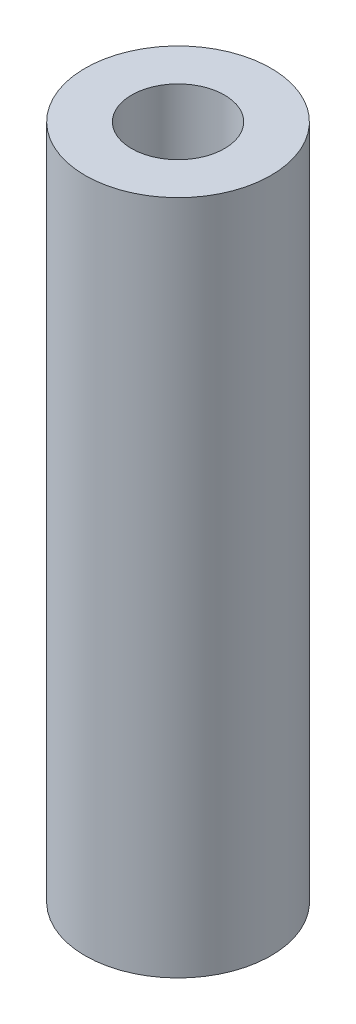
ISO-10303-21;
HEADER;
FILE_DESCRIPTION(('STEP AP214'),'2;1');
FILE_NAME('part.step','',(''),(''),'','','');
FILE_SCHEMA(('AUTOMOTIVE_DESIGN { 1 0 10303 214 1 1 1 1 }'));
ENDSEC;
DATA;
#1=APPLICATION_CONTEXT('core data for automotive mechanical design processes');
#2=APPLICATION_PROTOCOL_DEFINITION('international standard','automotive_design',2000,#1);
#3=PRODUCT_CONTEXT('',#1,'mechanical');
#4=PRODUCT('Part','Part','',(#3));
#5=PRODUCT_RELATED_PRODUCT_CATEGORY('part','',(#4));
#6=PRODUCT_DEFINITION_FORMATION('','',#4);
#7=PRODUCT_DEFINITION_CONTEXT('part definition',#1,'design');
#8=PRODUCT_DEFINITION('design','',#6,#7);
#9=PRODUCT_DEFINITION_SHAPE('','',#8);
#10=(LENGTH_UNIT() NAMED_UNIT(*) SI_UNIT(.MILLI.,.METRE.));
#11=(NAMED_UNIT(*) PLANE_ANGLE_UNIT() SI_UNIT($,.RADIAN.));
#12=(NAMED_UNIT(*) SI_UNIT($,.STERADIAN.) SOLID_ANGLE_UNIT());
#13=UNCERTAINTY_MEASURE_WITH_UNIT(LENGTH_MEASURE(1.E-05),#10,'distance_accuracy_value','');
#14=(GEOMETRIC_REPRESENTATION_CONTEXT(3) GLOBAL_UNCERTAINTY_ASSIGNED_CONTEXT((#13)) GLOBAL_UNIT_ASSIGNED_CONTEXT((#10,
#11,#12)) REPRESENTATION_CONTEXT('',''));
#15=CARTESIAN_POINT('',(0.,0.,0.));
#16=DIRECTION('',(0.,0.,1.));
#17=DIRECTION('',(1.,0.,0.));
#18=AXIS2_PLACEMENT_3D('',#15,#16,#17);
#19=CARTESIAN_POINT('',(0.,40.,0.));
#20=DIRECTION('',(0.,1.,0.));
#21=DIRECTION('',(0.,0.,1.));
#22=AXIS2_PLACEMENT_3D('',#19,#20,#21);
#23=PLANE('',#22);
#24=CARTESIAN_POINT('',(0.,40.,0.));
#25=DIRECTION('',(0.,1.,0.));
#26=DIRECTION('',(0.,0.,1.));
#27=AXIS2_PLACEMENT_3D('',#24,#25,#26);
#28=CIRCLE('',#27,11.);
#29=CARTESIAN_POINT('',(0.,40.,11.));
#30=VERTEX_POINT('',#29);
#31=EDGE_CURVE('E10',#30,#30,#28,.T.);
#32=ORIENTED_EDGE('',*,*,#31,.T.);
#33=EDGE_LOOP('',(#32));
#34=FACE_BOUND('',#33,.T.);
#35=CARTESIAN_POINT('',(0.,40.,0.));
#36=DIRECTION('',(0.,1.,0.));
#37=DIRECTION('',(0.,0.,1.));
#38=AXIS2_PLACEMENT_3D('',#35,#36,#37);
#39=CIRCLE('',#38,5.5);
#40=CARTESIAN_POINT('',(0.,40.,5.5));
#41=VERTEX_POINT('',#40);
#42=EDGE_CURVE('E42',#41,#41,#39,.T.);
#43=ORIENTED_EDGE('',*,*,#42,.F.);
#44=EDGE_LOOP('',(#43));
#45=FACE_BOUND('',#44,.T.);
#46=ADVANCED_FACE('F31',(#34,#45),#23,.T.);
#47=CARTESIAN_POINT('',(0.,-40.,0.));
#48=DIRECTION('',(0.,1.,0.));
#49=DIRECTION('',(0.,0.,1.));
#50=AXIS2_PLACEMENT_3D('',#47,#48,#49);
#51=PLANE('',#50);
#52=CARTESIAN_POINT('',(0.,-40.,0.));
#53=DIRECTION('',(0.,1.,0.));
#54=DIRECTION('',(0.,0.,1.));
#55=AXIS2_PLACEMENT_3D('',#52,#53,#54);
#56=CIRCLE('',#55,11.);
#57=CARTESIAN_POINT('',(0.,-40.,11.));
#58=VERTEX_POINT('',#57);
#59=EDGE_CURVE('E35',#58,#58,#56,.T.);
#60=ORIENTED_EDGE('',*,*,#59,.F.);
#61=EDGE_LOOP('',(#60));
#62=FACE_BOUND('',#61,.T.);
#63=CARTESIAN_POINT('',(0.,-40.,0.));
#64=DIRECTION('',(0.,1.,0.));
#65=DIRECTION('',(0.,0.,1.));
#66=AXIS2_PLACEMENT_3D('',#63,#64,#65);
#67=CIRCLE('',#66,5.5);
#68=CARTESIAN_POINT('',(0.,-40.,5.5));
#69=VERTEX_POINT('',#68);
#70=EDGE_CURVE('E44',#69,#69,#67,.T.);
#71=ORIENTED_EDGE('',*,*,#70,.T.);
#72=EDGE_LOOP('',(#71));
#73=FACE_BOUND('',#72,.T.);
#74=ADVANCED_FACE('F54',(#62,#73),#51,.F.);
#75=CARTESIAN_POINT('',(0.,40.,0.));
#76=DIRECTION('',(0.,-1.,0.));
#77=DIRECTION('',(0.,0.,-1.));
#78=AXIS2_PLACEMENT_3D('',#75,#76,#77);
#79=CYLINDRICAL_SURFACE('',#78,11.);
#80=ORIENTED_EDGE('',*,*,#31,.F.);
#81=EDGE_LOOP('',(#80));
#82=FACE_BOUND('',#81,.T.);
#83=ORIENTED_EDGE('',*,*,#59,.T.);
#84=EDGE_LOOP('',(#83));
#85=FACE_BOUND('',#84,.T.);
#86=ADVANCED_FACE('F33',(#82,#85),#79,.T.);
#87=CARTESIAN_POINT('',(0.,40.,0.));
#88=DIRECTION('',(0.,-1.,0.));
#89=DIRECTION('',(0.,0.,-1.));
#90=AXIS2_PLACEMENT_3D('',#87,#88,#89);
#91=CYLINDRICAL_SURFACE('',#90,5.5);
#92=ORIENTED_EDGE('',*,*,#42,.T.);
#93=EDGE_LOOP('',(#92));
#94=FACE_BOUND('',#93,.T.);
#95=ORIENTED_EDGE('',*,*,#70,.F.);
#96=EDGE_LOOP('',(#95));
#97=FACE_BOUND('',#96,.T.);
#98=ADVANCED_FACE('F50',(#94,#97),#91,.F.);
#99=CLOSED_SHELL('',(#46,#74,#86,#98));
#100=MANIFOLD_SOLID_BREP('B2',#99);
#101=ADVANCED_BREP_SHAPE_REPRESENTATION('',(#18,#100),#14);
#102=SHAPE_DEFINITION_REPRESENTATION(#9,#101);
ENDSEC;
END-ISO-10303-21;
